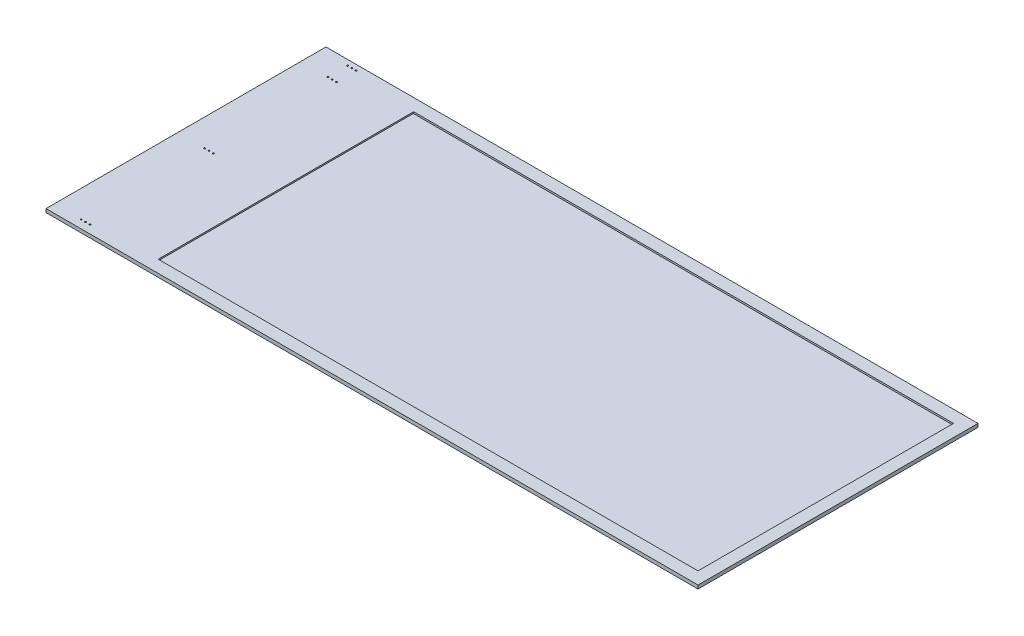
ISO-10303-21;
HEADER;
FILE_DESCRIPTION(('STEP AP214'),'2;1');
FILE_NAME('part.step','',(''),(''),'','','');
FILE_SCHEMA(('AUTOMOTIVE_DESIGN { 1 0 10303 214 1 1 1 1 }'));
ENDSEC;
DATA;
#1=APPLICATION_CONTEXT('core data for automotive mechanical design processes');
#2=APPLICATION_PROTOCOL_DEFINITION('international standard','automotive_design',2000,#1);
#3=PRODUCT_CONTEXT('',#1,'mechanical');
#4=PRODUCT('Part','Part','',(#3));
#5=PRODUCT_RELATED_PRODUCT_CATEGORY('part','',(#4));
#6=PRODUCT_DEFINITION_FORMATION('','',#4);
#7=PRODUCT_DEFINITION_CONTEXT('part definition',#1,'design');
#8=PRODUCT_DEFINITION('design','',#6,#7);
#9=PRODUCT_DEFINITION_SHAPE('','',#8);
#10=(LENGTH_UNIT() NAMED_UNIT(*) SI_UNIT(.MILLI.,.METRE.));
#11=(NAMED_UNIT(*) PLANE_ANGLE_UNIT() SI_UNIT($,.RADIAN.));
#12=(NAMED_UNIT(*) SI_UNIT($,.STERADIAN.) SOLID_ANGLE_UNIT());
#13=UNCERTAINTY_MEASURE_WITH_UNIT(LENGTH_MEASURE(1.E-05),#10,'distance_accuracy_value','');
#14=(GEOMETRIC_REPRESENTATION_CONTEXT(3) GLOBAL_UNCERTAINTY_ASSIGNED_CONTEXT((#13)) GLOBAL_UNIT_ASSIGNED_CONTEXT((#10,
#11,#12)) REPRESENTATION_CONTEXT('',''));
#15=CARTESIAN_POINT('',(0.,0.,0.));
#16=DIRECTION('',(0.,0.,1.));
#17=DIRECTION('',(1.,0.,0.));
#18=AXIS2_PLACEMENT_3D('',#15,#16,#17);
#19=CARTESIAN_POINT('',(125.4125,3.175,-485.775));
#20=DIRECTION('',(-1.,0.,0.));
#21=DIRECTION('',(0.,0.,1.));
#22=AXIS2_PLACEMENT_3D('',#19,#20,#21);
#23=PLANE('',#22);
#24=DIRECTION('',(0.,0.,-1.));
#25=VECTOR('',#24,1.);
#26=CARTESIAN_POINT('',(125.4125,3.81,0.));
#27=LINE('',#26,#25);
#28=CARTESIAN_POINT('',(125.4125,3.81,-22.225));
#29=VERTEX_POINT('',#28);
#30=CARTESIAN_POINT('',(125.4125,3.81,-485.775));
#31=VERTEX_POINT('',#30);
#32=EDGE_CURVE('E167',#29,#31,#27,.T.);
#33=ORIENTED_EDGE('',*,*,#32,.F.);
#34=DIRECTION('',(0.,1.,0.));
#35=VECTOR('',#34,1.);
#36=CARTESIAN_POINT('',(125.4125,3.175,-22.225));
#37=LINE('',#36,#35);
#38=CARTESIAN_POINT('',(125.4125,3.175,-22.225));
#39=VERTEX_POINT('',#38);
#40=EDGE_CURVE('E250',#39,#29,#37,.T.);
#41=ORIENTED_EDGE('',*,*,#40,.F.);
#42=DIRECTION('',(0.,0.,1.));
#43=VECTOR('',#42,1.);
#44=CARTESIAN_POINT('',(125.4125,3.175,-485.775));
#45=LINE('',#44,#43);
#46=CARTESIAN_POINT('',(125.4125,3.175,-485.775));
#47=VERTEX_POINT('',#46);
#48=EDGE_CURVE('E124',#47,#39,#45,.T.);
#49=ORIENTED_EDGE('',*,*,#48,.F.);
#50=DIRECTION('',(0.,1.,0.));
#51=VECTOR('',#50,1.);
#52=CARTESIAN_POINT('',(125.4125,3.175,-485.775));
#53=LINE('',#52,#51);
#54=EDGE_CURVE('E253',#47,#31,#53,.T.);
#55=ORIENTED_EDGE('',*,*,#54,.T.);
#56=EDGE_LOOP('',(#33,#41,#49,#55));
#57=FACE_BOUND('',#56,.T.);
#58=ADVANCED_FACE('F41',(#57),#23,.F.);
#59=CARTESIAN_POINT('',(0.,6.35,0.));
#60=DIRECTION('',(1.,0.,0.));
#61=DIRECTION('',(0.,0.,-1.));
#62=AXIS2_PLACEMENT_3D('',#59,#60,#61);
#63=PLANE('',#62);
#64=DIRECTION('',(0.,0.,1.));
#65=VECTOR('',#64,1.);
#66=CARTESIAN_POINT('',(0.,0.,0.));
#67=LINE('',#66,#65);
#68=CARTESIAN_POINT('',(0.,0.,-508.));
#69=VERTEX_POINT('',#68);
#70=CARTESIAN_POINT('',(0.,0.,0.));
#71=VERTEX_POINT('',#70);
#72=EDGE_CURVE('E255',#69,#71,#67,.T.);
#73=ORIENTED_EDGE('',*,*,#72,.T.);
#74=DIRECTION('',(0.,-1.,0.));
#75=VECTOR('',#74,1.);
#76=CARTESIAN_POINT('',(0.,6.35,0.));
#77=LINE('',#76,#75);
#78=CARTESIAN_POINT('',(0.,6.35,0.));
#79=VERTEX_POINT('',#78);
#80=EDGE_CURVE('E11',#79,#71,#77,.T.);
#81=ORIENTED_EDGE('',*,*,#80,.F.);
#82=DIRECTION('',(0.,0.,1.));
#83=VECTOR('',#82,1.);
#84=CARTESIAN_POINT('',(0.,6.35,0.));
#85=LINE('',#84,#83);
#86=CARTESIAN_POINT('',(0.,6.35,-508.));
#87=VERTEX_POINT('',#86);
#88=EDGE_CURVE('E257',#87,#79,#85,.T.);
#89=ORIENTED_EDGE('',*,*,#88,.F.);
#90=DIRECTION('',(0.,-1.,0.));
#91=VECTOR('',#90,1.);
#92=CARTESIAN_POINT('',(0.,6.35,-508.));
#93=LINE('',#92,#91);
#94=EDGE_CURVE('E49',#87,#69,#93,.T.);
#95=ORIENTED_EDGE('',*,*,#94,.T.);
#96=EDGE_LOOP('',(#73,#81,#89,#95));
#97=FACE_BOUND('',#96,.T.);
#98=ADVANCED_FACE('F43',(#97),#63,.F.);
#99=CARTESIAN_POINT('',(0.,6.35,0.));
#100=DIRECTION('',(0.,0.,-1.));
#101=DIRECTION('',(-1.,0.,0.));
#102=AXIS2_PLACEMENT_3D('',#99,#100,#101);
#103=PLANE('',#102);
#104=DIRECTION('',(1.,0.,0.));
#105=VECTOR('',#104,1.);
#106=CARTESIAN_POINT('',(0.,0.,0.));
#107=LINE('',#106,#105);
#108=CARTESIAN_POINT('',(1183.0812,0.,0.));
#109=VERTEX_POINT('',#108);
#110=EDGE_CURVE('E267',#71,#109,#107,.T.);
#111=ORIENTED_EDGE('',*,*,#110,.T.);
#112=DIRECTION('',(0.,1.,0.));
#113=VECTOR('',#112,1.);
#114=CARTESIAN_POINT('',(1183.0812,0.,0.));
#115=LINE('',#114,#113);
#116=CARTESIAN_POINT('',(1183.0812,6.35,0.));
#117=VERTEX_POINT('',#116);
#118=EDGE_CURVE('E151',#109,#117,#115,.T.);
#119=ORIENTED_EDGE('',*,*,#118,.T.);
#120=DIRECTION('',(1.,0.,0.));
#121=VECTOR('',#120,1.);
#122=CARTESIAN_POINT('',(0.,6.35,0.));
#123=LINE('',#122,#121);
#124=EDGE_CURVE('E260',#79,#117,#123,.T.);
#125=ORIENTED_EDGE('',*,*,#124,.F.);
#126=ORIENTED_EDGE('',*,*,#80,.T.);
#127=EDGE_LOOP('',(#111,#119,#125,#126));
#128=FACE_BOUND('',#127,.T.);
#129=ADVANCED_FACE('F282',(#128),#103,.F.);
#130=CARTESIAN_POINT('',(0.,6.35,-508.));
#131=DIRECTION('',(0.,0.,1.));
#132=DIRECTION('',(1.,0.,0.));
#133=AXIS2_PLACEMENT_3D('',#130,#131,#132);
#134=PLANE('',#133);
#135=DIRECTION('',(-1.,0.,0.));
#136=VECTOR('',#135,1.);
#137=CARTESIAN_POINT('',(0.,0.,-508.));
#138=LINE('',#137,#136);
#139=CARTESIAN_POINT('',(1183.0812,0.,-508.));
#140=VERTEX_POINT('',#139);
#141=EDGE_CURVE('E261',#140,#69,#138,.T.);
#142=ORIENTED_EDGE('',*,*,#141,.T.);
#143=ORIENTED_EDGE('',*,*,#94,.F.);
#144=DIRECTION('',(-1.,0.,0.));
#145=VECTOR('',#144,1.);
#146=CARTESIAN_POINT('',(0.,6.35,-508.));
#147=LINE('',#146,#145);
#148=CARTESIAN_POINT('',(1183.0812,6.35,-508.));
#149=VERTEX_POINT('',#148);
#150=EDGE_CURVE('E263',#149,#87,#147,.T.);
#151=ORIENTED_EDGE('',*,*,#150,.F.);
#152=DIRECTION('',(0.,1.,0.));
#153=VECTOR('',#152,1.);
#154=CARTESIAN_POINT('',(1183.0812,0.,-508.));
#155=LINE('',#154,#153);
#156=EDGE_CURVE('E154',#140,#149,#155,.T.);
#157=ORIENTED_EDGE('',*,*,#156,.F.);
#158=EDGE_LOOP('',(#142,#143,#151,#157));
#159=FACE_BOUND('',#158,.T.);
#160=ADVANCED_FACE('F286',(#159),#134,.F.);
#161=CARTESIAN_POINT('',(0.,6.35,0.));
#162=DIRECTION('',(0.,-1.,0.));
#163=DIRECTION('',(0.,0.,-1.));
#164=AXIS2_PLACEMENT_3D('',#161,#162,#163);
#165=PLANE('',#164);
#166=DIRECTION('',(-1.,0.,0.));
#167=VECTOR('',#166,1.);
#168=CARTESIAN_POINT('',(125.4125,6.35,-485.775));
#169=LINE('',#168,#167);
#170=CARTESIAN_POINT('',(1160.8562,6.35,-485.775));
#171=VERTEX_POINT('',#170);
#172=CARTESIAN_POINT('',(181.3306,6.35,-485.775));
#173=VERTEX_POINT('',#172);
#174=EDGE_CURVE('E247',#171,#173,#169,.T.);
#175=ORIENTED_EDGE('',*,*,#174,.F.);
#176=DIRECTION('',(0.,0.,-1.));
#177=VECTOR('',#176,1.);
#178=CARTESIAN_POINT('',(1160.8562,6.35,-485.775));
#179=LINE('',#178,#177);
#180=CARTESIAN_POINT('',(1160.8562,6.35,-22.225));
#181=VERTEX_POINT('',#180);
#182=EDGE_CURVE('E142',#181,#171,#179,.T.);
#183=ORIENTED_EDGE('',*,*,#182,.F.);
#184=DIRECTION('',(1.,0.,0.));
#185=VECTOR('',#184,1.);
#186=CARTESIAN_POINT('',(125.4125,6.35,-22.225));
#187=LINE('',#186,#185);
#188=CARTESIAN_POINT('',(181.3306,6.35,-22.225));
#189=VERTEX_POINT('',#188);
#190=EDGE_CURVE('E133',#189,#181,#187,.T.);
#191=ORIENTED_EDGE('',*,*,#190,.F.);
#192=DIRECTION('',(0.,0.,-1.));
#193=VECTOR('',#192,1.);
#194=CARTESIAN_POINT('',(181.3306,6.35,0.));
#195=LINE('',#194,#193);
#196=EDGE_CURVE('E157',#189,#173,#195,.T.);
#197=ORIENTED_EDGE('',*,*,#196,.T.);
#198=EDGE_LOOP('',(#175,#183,#191,#197));
#199=FACE_BOUND('',#198,.T.);
#200=CARTESIAN_POINT('',(64.5413999999999,6.35,-498.094));
#201=DIRECTION('',(0.,1.,0.));
#202=DIRECTION('',(0.,0.,1.));
#203=AXIS2_PLACEMENT_3D('',#200,#201,#202);
#204=CIRCLE('',#203,1.3589);
#205=CARTESIAN_POINT('',(64.5413999999999,6.35,-496.7351));
#206=VERTEX_POINT('',#205);
#207=EDGE_CURVE('E206',#206,#206,#204,.T.);
#208=ORIENTED_EDGE('',*,*,#207,.F.);
#209=EDGE_LOOP('',(#208));
#210=FACE_BOUND('',#209,.T.);
#211=CARTESIAN_POINT('',(49.1489999999999,6.35,-14.8082));
#212=DIRECTION('',(0.,1.,0.));
#213=DIRECTION('',(0.,0.,1.));
#214=AXIS2_PLACEMENT_3D('',#211,#212,#213);
#215=CIRCLE('',#214,1.35889999999999);
#216=CARTESIAN_POINT('',(49.1489999999999,6.35,-13.4493));
#217=VERTEX_POINT('',#216);
#218=EDGE_CURVE('E213',#217,#217,#215,.T.);
#219=ORIENTED_EDGE('',*,*,#218,.F.);
#220=EDGE_LOOP('',(#219));
#221=FACE_BOUND('',#220,.T.);
#222=CARTESIAN_POINT('',(57.0991999999999,6.35,-14.8082));
#223=DIRECTION('',(0.,1.,0.));
#224=DIRECTION('',(0.,0.,1.));
#225=AXIS2_PLACEMENT_3D('',#222,#223,#224);
#226=CIRCLE('',#225,1.35889999999999);
#227=CARTESIAN_POINT('',(57.0991999999999,6.35,-13.4493));
#228=VERTEX_POINT('',#227);
#229=EDGE_CURVE('E194',#228,#228,#226,.T.);
#230=ORIENTED_EDGE('',*,*,#229,.F.);
#231=EDGE_LOOP('',(#230));
#232=FACE_BOUND('',#231,.T.);
#233=CARTESIAN_POINT('',(65.0493999999999,6.35,-14.8082));
#234=DIRECTION('',(0.,1.,0.));
#235=DIRECTION('',(0.,0.,1.));
#236=AXIS2_PLACEMENT_3D('',#233,#234,#235);
#237=CIRCLE('',#236,1.3589);
#238=CARTESIAN_POINT('',(65.0493999999999,6.35,-13.4493));
#239=VERTEX_POINT('',#238);
#240=EDGE_CURVE('E201',#239,#239,#237,.T.);
#241=ORIENTED_EDGE('',*,*,#240,.F.);
#242=EDGE_LOOP('',(#241));
#243=FACE_BOUND('',#242,.T.);
#244=CARTESIAN_POINT('',(49.1489999999999,6.35,-498.094));
#245=DIRECTION('',(0.,1.,0.));
#246=DIRECTION('',(0.,0.,1.));
#247=AXIS2_PLACEMENT_3D('',#244,#245,#246);
#248=CIRCLE('',#247,1.3589);
#249=CARTESIAN_POINT('',(49.1489999999999,6.35,-496.7351));
#250=VERTEX_POINT('',#249);
#251=EDGE_CURVE('E230',#250,#250,#248,.T.);
#252=ORIENTED_EDGE('',*,*,#251,.F.);
#253=EDGE_LOOP('',(#252));
#254=FACE_BOUND('',#253,.T.);
#255=CARTESIAN_POINT('',(56.8451999999999,6.35,-462.4832));
#256=DIRECTION('',(0.,1.,0.));
#257=DIRECTION('',(0.,0.,1.));
#258=AXIS2_PLACEMENT_3D('',#255,#256,#257);
#259=CIRCLE('',#258,1.3589);
#260=CARTESIAN_POINT('',(56.8451999999999,6.35,-461.1243));
#261=VERTEX_POINT('',#260);
#262=EDGE_CURVE('E237',#261,#261,#259,.T.);
#263=ORIENTED_EDGE('',*,*,#262,.F.);
#264=EDGE_LOOP('',(#263));
#265=FACE_BOUND('',#264,.T.);
#266=CARTESIAN_POINT('',(56.8451999999999,6.35,-498.094));
#267=DIRECTION('',(0.,1.,0.));
#268=DIRECTION('',(0.,0.,1.));
#269=AXIS2_PLACEMENT_3D('',#266,#267,#268);
#270=CIRCLE('',#269,1.3589);
#271=CARTESIAN_POINT('',(56.8451999999999,6.35,-496.7351));
#272=VERTEX_POINT('',#271);
#273=EDGE_CURVE('E218',#272,#272,#270,.T.);
#274=ORIENTED_EDGE('',*,*,#273,.F.);
#275=EDGE_LOOP('',(#274));
#276=FACE_BOUND('',#275,.T.);
#277=CARTESIAN_POINT('',(64.5413999999999,6.35,-462.4832));
#278=DIRECTION('',(0.,1.,0.));
#279=DIRECTION('',(0.,0.,1.));
#280=AXIS2_PLACEMENT_3D('',#277,#278,#279);
#281=CIRCLE('',#280,1.3589);
#282=CARTESIAN_POINT('',(64.5413999999999,6.35,-461.1243));
#283=VERTEX_POINT('',#282);
#284=EDGE_CURVE('E225',#283,#283,#281,.T.);
#285=ORIENTED_EDGE('',*,*,#284,.F.);
#286=EDGE_LOOP('',(#285));
#287=FACE_BOUND('',#286,.T.);
#288=CARTESIAN_POINT('',(49.1489999999999,6.35,-238.6457));
#289=DIRECTION('',(0.,1.,0.));
#290=DIRECTION('',(0.,0.,1.));
#291=AXIS2_PLACEMENT_3D('',#288,#289,#290);
#292=CIRCLE('',#291,1.35889999999999);
#293=CARTESIAN_POINT('',(49.1489999999999,6.35,-237.2868));
#294=VERTEX_POINT('',#293);
#295=EDGE_CURVE('E176',#294,#294,#292,.T.);
#296=ORIENTED_EDGE('',*,*,#295,.F.);
#297=EDGE_LOOP('',(#296));
#298=FACE_BOUND('',#297,.T.);
#299=CARTESIAN_POINT('',(57.0991999999999,6.35,-238.6457));
#300=DIRECTION('',(0.,1.,0.));
#301=DIRECTION('',(0.,0.,1.));
#302=AXIS2_PLACEMENT_3D('',#299,#300,#301);
#303=CIRCLE('',#302,1.35889999999999);
#304=CARTESIAN_POINT('',(57.0991999999999,6.35,-237.2868));
#305=VERTEX_POINT('',#304);
#306=EDGE_CURVE('E183',#305,#305,#303,.T.);
#307=ORIENTED_EDGE('',*,*,#306,.F.);
#308=EDGE_LOOP('',(#307));
#309=FACE_BOUND('',#308,.T.);
#310=CARTESIAN_POINT('',(65.0493999999999,6.35,-238.6457));
#311=DIRECTION('',(0.,1.,0.));
#312=DIRECTION('',(0.,0.,1.));
#313=AXIS2_PLACEMENT_3D('',#310,#311,#312);
#314=CIRCLE('',#313,1.3589);
#315=CARTESIAN_POINT('',(65.0493999999999,6.35,-237.2868));
#316=VERTEX_POINT('',#315);
#317=EDGE_CURVE('E189',#316,#316,#314,.T.);
#318=ORIENTED_EDGE('',*,*,#317,.F.);
#319=EDGE_LOOP('',(#318));
#320=FACE_BOUND('',#319,.T.);
#321=CARTESIAN_POINT('',(49.1489999999999,6.35,-462.4832));
#322=DIRECTION('',(0.,1.,0.));
#323=DIRECTION('',(0.,0.,1.));
#324=AXIS2_PLACEMENT_3D('',#321,#322,#323);
#325=CIRCLE('',#324,1.3589);
#326=CARTESIAN_POINT('',(49.1489999999999,6.35,-461.1243));
#327=VERTEX_POINT('',#326);
#328=EDGE_CURVE('E233',#327,#327,#325,.T.);
#329=ORIENTED_EDGE('',*,*,#328,.F.);
#330=EDGE_LOOP('',(#329));
#331=FACE_BOUND('',#330,.T.);
#332=ORIENTED_EDGE('',*,*,#88,.T.);
#333=ORIENTED_EDGE('',*,*,#124,.T.);
#334=DIRECTION('',(0.,0.,-1.));
#335=VECTOR('',#334,1.);
#336=CARTESIAN_POINT('',(1183.0812,6.35,-508.));
#337=LINE('',#336,#335);
#338=EDGE_CURVE('E146',#117,#149,#337,.T.);
#339=ORIENTED_EDGE('',*,*,#338,.T.);
#340=ORIENTED_EDGE('',*,*,#150,.T.);
#341=EDGE_LOOP('',(#332,#333,#339,#340));
#342=FACE_BOUND('',#341,.T.);
#343=ADVANCED_FACE('F285',(#199,#210,#221,#232,#243,#254,#265,#276,#287,#298,#309,#320,#331,
#342),#165,.F.);
#344=CARTESIAN_POINT('',(0.,0.,0.));
#345=DIRECTION('',(0.,-1.,0.));
#346=DIRECTION('',(0.,0.,-1.));
#347=AXIS2_PLACEMENT_3D('',#344,#345,#346);
#348=PLANE('',#347);
#349=CARTESIAN_POINT('',(64.5413999999999,0.,-498.094));
#350=DIRECTION('',(0.,1.,0.));
#351=DIRECTION('',(0.,0.,1.));
#352=AXIS2_PLACEMENT_3D('',#349,#350,#351);
#353=CIRCLE('',#352,1.3589);
#354=CARTESIAN_POINT('',(64.5413999999999,0.,-496.7351));
#355=VERTEX_POINT('',#354);
#356=EDGE_CURVE('E210',#355,#355,#353,.T.);
#357=ORIENTED_EDGE('',*,*,#356,.T.);
#358=EDGE_LOOP('',(#357));
#359=FACE_BOUND('',#358,.T.);
#360=CARTESIAN_POINT('',(49.1489999999999,0.,-14.8082));
#361=DIRECTION('',(0.,1.,0.));
#362=DIRECTION('',(0.,0.,1.));
#363=AXIS2_PLACEMENT_3D('',#360,#361,#362);
#364=CIRCLE('',#363,1.35889999999999);
#365=CARTESIAN_POINT('',(49.1489999999999,0.,-13.4493));
#366=VERTEX_POINT('',#365);
#367=EDGE_CURVE('E197',#366,#366,#364,.T.);
#368=ORIENTED_EDGE('',*,*,#367,.T.);
#369=EDGE_LOOP('',(#368));
#370=FACE_BOUND('',#369,.T.);
#371=CARTESIAN_POINT('',(57.0991999999999,0.,-14.8082));
#372=DIRECTION('',(0.,1.,0.));
#373=DIRECTION('',(0.,0.,1.));
#374=AXIS2_PLACEMENT_3D('',#371,#372,#373);
#375=CIRCLE('',#374,1.35889999999999);
#376=CARTESIAN_POINT('',(57.0991999999999,0.,-13.4493));
#377=VERTEX_POINT('',#376);
#378=EDGE_CURVE('E198',#377,#377,#375,.T.);
#379=ORIENTED_EDGE('',*,*,#378,.T.);
#380=EDGE_LOOP('',(#379));
#381=FACE_BOUND('',#380,.T.);
#382=CARTESIAN_POINT('',(65.0493999999999,0.,-14.8082));
#383=DIRECTION('',(0.,1.,0.));
#384=DIRECTION('',(0.,0.,1.));
#385=AXIS2_PLACEMENT_3D('',#382,#383,#384);
#386=CIRCLE('',#385,1.3589);
#387=CARTESIAN_POINT('',(65.0493999999999,0.,-13.4493));
#388=VERTEX_POINT('',#387);
#389=EDGE_CURVE('E179',#388,#388,#386,.T.);
#390=ORIENTED_EDGE('',*,*,#389,.T.);
#391=EDGE_LOOP('',(#390));
#392=FACE_BOUND('',#391,.T.);
#393=CARTESIAN_POINT('',(49.1489999999999,0.,-498.094));
#394=DIRECTION('',(0.,1.,0.));
#395=DIRECTION('',(0.,0.,1.));
#396=AXIS2_PLACEMENT_3D('',#393,#394,#395);
#397=CIRCLE('',#396,1.3589);
#398=CARTESIAN_POINT('',(49.1489999999999,0.,-496.7351));
#399=VERTEX_POINT('',#398);
#400=EDGE_CURVE('E234',#399,#399,#397,.T.);
#401=ORIENTED_EDGE('',*,*,#400,.T.);
#402=EDGE_LOOP('',(#401));
#403=FACE_BOUND('',#402,.T.);
#404=CARTESIAN_POINT('',(56.8451999999999,0.,-462.4832));
#405=DIRECTION('',(0.,1.,0.));
#406=DIRECTION('',(0.,0.,1.));
#407=AXIS2_PLACEMENT_3D('',#404,#405,#406);
#408=CIRCLE('',#407,1.3589);
#409=CARTESIAN_POINT('',(56.8451999999999,0.,-461.1243));
#410=VERTEX_POINT('',#409);
#411=EDGE_CURVE('E221',#410,#410,#408,.T.);
#412=ORIENTED_EDGE('',*,*,#411,.T.);
#413=EDGE_LOOP('',(#412));
#414=FACE_BOUND('',#413,.T.);
#415=CARTESIAN_POINT('',(56.8451999999999,0.,-498.094));
#416=DIRECTION('',(0.,1.,0.));
#417=DIRECTION('',(0.,0.,1.));
#418=AXIS2_PLACEMENT_3D('',#415,#416,#417);
#419=CIRCLE('',#418,1.3589);
#420=CARTESIAN_POINT('',(56.8451999999999,0.,-496.7351));
#421=VERTEX_POINT('',#420);
#422=EDGE_CURVE('E222',#421,#421,#419,.T.);
#423=ORIENTED_EDGE('',*,*,#422,.T.);
#424=EDGE_LOOP('',(#423));
#425=FACE_BOUND('',#424,.T.);
#426=CARTESIAN_POINT('',(64.5413999999999,0.,-462.4832));
#427=DIRECTION('',(0.,1.,0.));
#428=DIRECTION('',(0.,0.,1.));
#429=AXIS2_PLACEMENT_3D('',#426,#427,#428);
#430=CIRCLE('',#429,1.3589);
#431=CARTESIAN_POINT('',(64.5413999999999,0.,-461.1243));
#432=VERTEX_POINT('',#431);
#433=EDGE_CURVE('E209',#432,#432,#430,.T.);
#434=ORIENTED_EDGE('',*,*,#433,.T.);
#435=EDGE_LOOP('',(#434));
#436=FACE_BOUND('',#435,.T.);
#437=CARTESIAN_POINT('',(49.1489999999999,0.,-238.6457));
#438=DIRECTION('',(0.,1.,0.));
#439=DIRECTION('',(0.,0.,1.));
#440=AXIS2_PLACEMENT_3D('',#437,#438,#439);
#441=CIRCLE('',#440,1.35889999999999);
#442=CARTESIAN_POINT('',(49.1489999999999,0.,-237.2868));
#443=VERTEX_POINT('',#442);
#444=EDGE_CURVE('E180',#443,#443,#441,.T.);
#445=ORIENTED_EDGE('',*,*,#444,.T.);
#446=EDGE_LOOP('',(#445));
#447=FACE_BOUND('',#446,.T.);
#448=CARTESIAN_POINT('',(57.0991999999999,0.,-238.6457));
#449=DIRECTION('',(0.,1.,0.));
#450=DIRECTION('',(0.,0.,1.));
#451=AXIS2_PLACEMENT_3D('',#448,#449,#450);
#452=CIRCLE('',#451,1.35889999999999);
#453=CARTESIAN_POINT('',(57.0991999999999,0.,-237.2868));
#454=VERTEX_POINT('',#453);
#455=EDGE_CURVE('E186',#454,#454,#452,.T.);
#456=ORIENTED_EDGE('',*,*,#455,.T.);
#457=EDGE_LOOP('',(#456));
#458=FACE_BOUND('',#457,.T.);
#459=CARTESIAN_POINT('',(65.0493999999999,0.,-238.6457));
#460=DIRECTION('',(0.,1.,0.));
#461=DIRECTION('',(0.,0.,1.));
#462=AXIS2_PLACEMENT_3D('',#459,#460,#461);
#463=CIRCLE('',#462,1.3589);
#464=CARTESIAN_POINT('',(65.0493999999999,0.,-237.2868));
#465=VERTEX_POINT('',#464);
#466=EDGE_CURVE('E174',#465,#465,#463,.T.);
#467=ORIENTED_EDGE('',*,*,#466,.T.);
#468=EDGE_LOOP('',(#467));
#469=FACE_BOUND('',#468,.T.);
#470=CARTESIAN_POINT('',(49.1489999999999,0.,-462.4832));
#471=DIRECTION('',(0.,1.,0.));
#472=DIRECTION('',(0.,0.,1.));
#473=AXIS2_PLACEMENT_3D('',#470,#471,#472);
#474=CIRCLE('',#473,1.3589);
#475=CARTESIAN_POINT('',(49.1489999999999,0.,-461.1243));
#476=VERTEX_POINT('',#475);
#477=EDGE_CURVE('E242',#476,#476,#474,.T.);
#478=ORIENTED_EDGE('',*,*,#477,.T.);
#479=EDGE_LOOP('',(#478));
#480=FACE_BOUND('',#479,.T.);
#481=ORIENTED_EDGE('',*,*,#72,.F.);
#482=ORIENTED_EDGE('',*,*,#141,.F.);
#483=DIRECTION('',(0.,0.,-1.));
#484=VECTOR('',#483,1.);
#485=CARTESIAN_POINT('',(1183.0812,0.,-508.));
#486=LINE('',#485,#484);
#487=EDGE_CURVE('E148',#109,#140,#486,.T.);
#488=ORIENTED_EDGE('',*,*,#487,.F.);
#489=ORIENTED_EDGE('',*,*,#110,.F.);
#490=EDGE_LOOP('',(#481,#482,#488,#489));
#491=FACE_BOUND('',#490,.T.);
#492=ADVANCED_FACE('F277',(#359,#370,#381,#392,#403,#414,#425,#436,#447,#458,#469,#480,#491),
#348,.T.);
#493=CARTESIAN_POINT('',(125.4125,3.175,-485.775));
#494=DIRECTION('',(0.,0.,-1.));
#495=DIRECTION('',(-1.,0.,0.));
#496=AXIS2_PLACEMENT_3D('',#493,#494,#495);
#497=PLANE('',#496);
#498=ORIENTED_EDGE('',*,*,#174,.T.);
#499=DIRECTION('',(0.,1.,0.));
#500=VECTOR('',#499,1.);
#501=CARTESIAN_POINT('',(181.3306,3.81,-485.775));
#502=LINE('',#501,#500);
#503=CARTESIAN_POINT('',(181.3306,3.81,-485.775));
#504=VERTEX_POINT('',#503);
#505=EDGE_CURVE('E56',#504,#173,#502,.T.);
#506=ORIENTED_EDGE('',*,*,#505,.F.);
#507=DIRECTION('',(1.,0.,0.));
#508=VECTOR('',#507,1.);
#509=CARTESIAN_POINT('',(0.,3.81,-485.775));
#510=LINE('',#509,#508);
#511=EDGE_CURVE('E60',#31,#504,#510,.T.);
#512=ORIENTED_EDGE('',*,*,#511,.F.);
#513=ORIENTED_EDGE('',*,*,#54,.F.);
#514=DIRECTION('',(-1.,0.,0.));
#515=VECTOR('',#514,1.);
#516=CARTESIAN_POINT('',(125.4125,3.175,-485.775));
#517=LINE('',#516,#515);
#518=CARTESIAN_POINT('',(1160.8562,3.175,-485.775));
#519=VERTEX_POINT('',#518);
#520=EDGE_CURVE('E127',#519,#47,#517,.T.);
#521=ORIENTED_EDGE('',*,*,#520,.F.);
#522=DIRECTION('',(0.,1.,0.));
#523=VECTOR('',#522,1.);
#524=CARTESIAN_POINT('',(1160.8562,3.175,-485.775));
#525=LINE('',#524,#523);
#526=EDGE_CURVE('E137',#519,#171,#525,.T.);
#527=ORIENTED_EDGE('',*,*,#526,.T.);
#528=EDGE_LOOP('',(#498,#506,#512,#513,#521,#527));
#529=FACE_BOUND('',#528,.T.);
#530=ADVANCED_FACE('F316',(#529),#497,.F.);
#531=CARTESIAN_POINT('',(125.4125,3.175,-22.225));
#532=DIRECTION('',(0.,0.,1.));
#533=DIRECTION('',(1.,0.,0.));
#534=AXIS2_PLACEMENT_3D('',#531,#532,#533);
#535=PLANE('',#534);
#536=DIRECTION('',(-1.,0.,0.));
#537=VECTOR('',#536,1.);
#538=CARTESIAN_POINT('',(0.,3.81,-22.225));
#539=LINE('',#538,#537);
#540=CARTESIAN_POINT('',(181.3306,3.81,-22.225));
#541=VERTEX_POINT('',#540);
#542=EDGE_CURVE('E160',#541,#29,#539,.T.);
#543=ORIENTED_EDGE('',*,*,#542,.F.);
#544=DIRECTION('',(0.,1.,0.));
#545=VECTOR('',#544,1.);
#546=CARTESIAN_POINT('',(181.3306,3.81,-22.225));
#547=LINE('',#546,#545);
#548=EDGE_CURVE('E170',#541,#189,#547,.T.);
#549=ORIENTED_EDGE('',*,*,#548,.T.);
#550=ORIENTED_EDGE('',*,*,#190,.T.);
#551=DIRECTION('',(0.,1.,0.));
#552=VECTOR('',#551,1.);
#553=CARTESIAN_POINT('',(1160.8562,3.175,-22.225));
#554=LINE('',#553,#552);
#555=CARTESIAN_POINT('',(1160.8562,3.175,-22.225));
#556=VERTEX_POINT('',#555);
#557=EDGE_CURVE('E130',#556,#181,#554,.T.);
#558=ORIENTED_EDGE('',*,*,#557,.F.);
#559=DIRECTION('',(1.,0.,0.));
#560=VECTOR('',#559,1.);
#561=CARTESIAN_POINT('',(125.4125,3.175,-22.225));
#562=LINE('',#561,#560);
#563=EDGE_CURVE('E117',#39,#556,#562,.T.);
#564=ORIENTED_EDGE('',*,*,#563,.F.);
#565=ORIENTED_EDGE('',*,*,#40,.T.);
#566=EDGE_LOOP('',(#543,#549,#550,#558,#564,#565));
#567=FACE_BOUND('',#566,.T.);
#568=ADVANCED_FACE('F131',(#567),#535,.F.);
#569=CARTESIAN_POINT('',(0.,3.175,0.));
#570=DIRECTION('',(0.,1.,0.));
#571=DIRECTION('',(0.,0.,1.));
#572=AXIS2_PLACEMENT_3D('',#569,#570,#571);
#573=PLANE('',#572);
#574=ORIENTED_EDGE('',*,*,#48,.T.);
#575=ORIENTED_EDGE('',*,*,#563,.T.);
#576=DIRECTION('',(0.,0.,-1.));
#577=VECTOR('',#576,1.);
#578=CARTESIAN_POINT('',(1160.8562,3.175,-485.775));
#579=LINE('',#578,#577);
#580=EDGE_CURVE('E122',#556,#519,#579,.T.);
#581=ORIENTED_EDGE('',*,*,#580,.T.);
#582=ORIENTED_EDGE('',*,*,#520,.T.);
#583=EDGE_LOOP('',(#574,#575,#581,#582));
#584=FACE_BOUND('',#583,.T.);
#585=ADVANCED_FACE('F119',(#584),#573,.T.);
#586=CARTESIAN_POINT('',(49.1489999999999,0.,-462.4832));
#587=DIRECTION('',(0.,1.,0.));
#588=DIRECTION('',(0.,0.,1.));
#589=AXIS2_PLACEMENT_3D('',#586,#587,#588);
#590=CYLINDRICAL_SURFACE('',#589,1.3589);
#591=ORIENTED_EDGE('',*,*,#477,.F.);
#592=EDGE_LOOP('',(#591));
#593=FACE_BOUND('',#592,.T.);
#594=ORIENTED_EDGE('',*,*,#328,.T.);
#595=EDGE_LOOP('',(#594));
#596=FACE_BOUND('',#595,.T.);
#597=ADVANCED_FACE('F354',(#593,#596),#590,.F.);
#598=CARTESIAN_POINT('',(65.0493999999999,0.,-238.6457));
#599=DIRECTION('',(0.,1.,0.));
#600=DIRECTION('',(0.,0.,1.));
#601=AXIS2_PLACEMENT_3D('',#598,#599,#600);
#602=CYLINDRICAL_SURFACE('',#601,1.3589);
#603=ORIENTED_EDGE('',*,*,#466,.F.);
#604=EDGE_LOOP('',(#603));
#605=FACE_BOUND('',#604,.T.);
#606=ORIENTED_EDGE('',*,*,#317,.T.);
#607=EDGE_LOOP('',(#606));
#608=FACE_BOUND('',#607,.T.);
#609=ADVANCED_FACE('F530',(#605,#608),#602,.F.);
#610=CARTESIAN_POINT('',(57.0991999999999,0.,-238.6457));
#611=DIRECTION('',(0.,1.,0.));
#612=DIRECTION('',(0.,0.,1.));
#613=AXIS2_PLACEMENT_3D('',#610,#611,#612);
#614=CYLINDRICAL_SURFACE('',#613,1.35889999999999);
#615=ORIENTED_EDGE('',*,*,#455,.F.);
#616=EDGE_LOOP('',(#615));
#617=FACE_BOUND('',#616,.T.);
#618=ORIENTED_EDGE('',*,*,#306,.T.);
#619=EDGE_LOOP('',(#618));
#620=FACE_BOUND('',#619,.T.);
#621=ADVANCED_FACE('F520',(#617,#620),#614,.F.);
#622=CARTESIAN_POINT('',(49.1489999999999,0.,-238.6457));
#623=DIRECTION('',(0.,1.,0.));
#624=DIRECTION('',(0.,0.,1.));
#625=AXIS2_PLACEMENT_3D('',#622,#623,#624);
#626=CYLINDRICAL_SURFACE('',#625,1.35889999999999);
#627=ORIENTED_EDGE('',*,*,#444,.F.);
#628=EDGE_LOOP('',(#627));
#629=FACE_BOUND('',#628,.T.);
#630=ORIENTED_EDGE('',*,*,#295,.T.);
#631=EDGE_LOOP('',(#630));
#632=FACE_BOUND('',#631,.T.);
#633=ADVANCED_FACE('F510',(#629,#632),#626,.F.);
#634=CARTESIAN_POINT('',(64.5413999999999,0.,-462.4832));
#635=DIRECTION('',(0.,1.,0.));
#636=DIRECTION('',(0.,0.,1.));
#637=AXIS2_PLACEMENT_3D('',#634,#635,#636);
#638=CYLINDRICAL_SURFACE('',#637,1.3589);
#639=ORIENTED_EDGE('',*,*,#433,.F.);
#640=EDGE_LOOP('',(#639));
#641=FACE_BOUND('',#640,.T.);
#642=ORIENTED_EDGE('',*,*,#284,.T.);
#643=EDGE_LOOP('',(#642));
#644=FACE_BOUND('',#643,.T.);
#645=ADVANCED_FACE('F500',(#641,#644),#638,.F.);
#646=CARTESIAN_POINT('',(56.8451999999999,0.,-498.094));
#647=DIRECTION('',(0.,1.,0.));
#648=DIRECTION('',(0.,0.,1.));
#649=AXIS2_PLACEMENT_3D('',#646,#647,#648);
#650=CYLINDRICAL_SURFACE('',#649,1.3589);
#651=ORIENTED_EDGE('',*,*,#422,.F.);
#652=EDGE_LOOP('',(#651));
#653=FACE_BOUND('',#652,.T.);
#654=ORIENTED_EDGE('',*,*,#273,.T.);
#655=EDGE_LOOP('',(#654));
#656=FACE_BOUND('',#655,.T.);
#657=ADVANCED_FACE('F490',(#653,#656),#650,.F.);
#658=CARTESIAN_POINT('',(56.8451999999999,0.,-462.4832));
#659=DIRECTION('',(0.,1.,0.));
#660=DIRECTION('',(0.,0.,1.));
#661=AXIS2_PLACEMENT_3D('',#658,#659,#660);
#662=CYLINDRICAL_SURFACE('',#661,1.3589);
#663=ORIENTED_EDGE('',*,*,#411,.F.);
#664=EDGE_LOOP('',(#663));
#665=FACE_BOUND('',#664,.T.);
#666=ORIENTED_EDGE('',*,*,#262,.T.);
#667=EDGE_LOOP('',(#666));
#668=FACE_BOUND('',#667,.T.);
#669=ADVANCED_FACE('F480',(#665,#668),#662,.F.);
#670=CARTESIAN_POINT('',(49.1489999999999,0.,-498.094));
#671=DIRECTION('',(0.,1.,0.));
#672=DIRECTION('',(0.,0.,1.));
#673=AXIS2_PLACEMENT_3D('',#670,#671,#672);
#674=CYLINDRICAL_SURFACE('',#673,1.3589);
#675=ORIENTED_EDGE('',*,*,#400,.F.);
#676=EDGE_LOOP('',(#675));
#677=FACE_BOUND('',#676,.T.);
#678=ORIENTED_EDGE('',*,*,#251,.T.);
#679=EDGE_LOOP('',(#678));
#680=FACE_BOUND('',#679,.T.);
#681=ADVANCED_FACE('F470',(#677,#680),#674,.F.);
#682=CARTESIAN_POINT('',(65.0493999999999,0.,-14.8082));
#683=DIRECTION('',(0.,1.,0.));
#684=DIRECTION('',(0.,0.,1.));
#685=AXIS2_PLACEMENT_3D('',#682,#683,#684);
#686=CYLINDRICAL_SURFACE('',#685,1.3589);
#687=ORIENTED_EDGE('',*,*,#389,.F.);
#688=EDGE_LOOP('',(#687));
#689=FACE_BOUND('',#688,.T.);
#690=ORIENTED_EDGE('',*,*,#240,.T.);
#691=EDGE_LOOP('',(#690));
#692=FACE_BOUND('',#691,.T.);
#693=ADVANCED_FACE('F460',(#689,#692),#686,.F.);
#694=CARTESIAN_POINT('',(57.0991999999999,0.,-14.8082));
#695=DIRECTION('',(0.,1.,0.));
#696=DIRECTION('',(0.,0.,1.));
#697=AXIS2_PLACEMENT_3D('',#694,#695,#696);
#698=CYLINDRICAL_SURFACE('',#697,1.35889999999999);
#699=ORIENTED_EDGE('',*,*,#378,.F.);
#700=EDGE_LOOP('',(#699));
#701=FACE_BOUND('',#700,.T.);
#702=ORIENTED_EDGE('',*,*,#229,.T.);
#703=EDGE_LOOP('',(#702));
#704=FACE_BOUND('',#703,.T.);
#705=ADVANCED_FACE('F450',(#701,#704),#698,.F.);
#706=CARTESIAN_POINT('',(49.1489999999999,0.,-14.8082));
#707=DIRECTION('',(0.,1.,0.));
#708=DIRECTION('',(0.,0.,1.));
#709=AXIS2_PLACEMENT_3D('',#706,#707,#708);
#710=CYLINDRICAL_SURFACE('',#709,1.35889999999999);
#711=ORIENTED_EDGE('',*,*,#367,.F.);
#712=EDGE_LOOP('',(#711));
#713=FACE_BOUND('',#712,.T.);
#714=ORIENTED_EDGE('',*,*,#218,.T.);
#715=EDGE_LOOP('',(#714));
#716=FACE_BOUND('',#715,.T.);
#717=ADVANCED_FACE('F441',(#713,#716),#710,.F.);
#718=CARTESIAN_POINT('',(64.5413999999999,0.,-498.094));
#719=DIRECTION('',(0.,1.,0.));
#720=DIRECTION('',(0.,0.,1.));
#721=AXIS2_PLACEMENT_3D('',#718,#719,#720);
#722=CYLINDRICAL_SURFACE('',#721,1.3589);
#723=ORIENTED_EDGE('',*,*,#356,.F.);
#724=EDGE_LOOP('',(#723));
#725=FACE_BOUND('',#724,.T.);
#726=ORIENTED_EDGE('',*,*,#207,.T.);
#727=EDGE_LOOP('',(#726));
#728=FACE_BOUND('',#727,.T.);
#729=ADVANCED_FACE('F360',(#725,#728),#722,.F.);
#730=CARTESIAN_POINT('',(181.3306,3.81,0.));
#731=DIRECTION('',(1.,0.,0.));
#732=DIRECTION('',(0.,0.,-1.));
#733=AXIS2_PLACEMENT_3D('',#730,#731,#732);
#734=PLANE('',#733);
#735=ORIENTED_EDGE('',*,*,#196,.F.);
#736=ORIENTED_EDGE('',*,*,#548,.F.);
#737=DIRECTION('',(0.,0.,-1.));
#738=VECTOR('',#737,1.);
#739=CARTESIAN_POINT('',(181.3306,3.81,0.));
#740=LINE('',#739,#738);
#741=EDGE_CURVE('E163',#541,#504,#740,.T.);
#742=ORIENTED_EDGE('',*,*,#741,.T.);
#743=ORIENTED_EDGE('',*,*,#505,.T.);
#744=EDGE_LOOP('',(#735,#736,#742,#743));
#745=FACE_BOUND('',#744,.T.);
#746=ADVANCED_FACE('F297',(#745),#734,.T.);
#747=CARTESIAN_POINT('',(0.,3.81,0.));
#748=DIRECTION('',(0.,1.,0.));
#749=DIRECTION('',(0.,0.,1.));
#750=AXIS2_PLACEMENT_3D('',#747,#748,#749);
#751=PLANE('',#750);
#752=ORIENTED_EDGE('',*,*,#542,.T.);
#753=ORIENTED_EDGE('',*,*,#32,.T.);
#754=ORIENTED_EDGE('',*,*,#511,.T.);
#755=ORIENTED_EDGE('',*,*,#741,.F.);
#756=EDGE_LOOP('',(#752,#753,#754,#755));
#757=FACE_BOUND('',#756,.T.);
#758=ADVANCED_FACE('F290',(#757),#751,.F.);
#759=CARTESIAN_POINT('',(1183.0812,0.,-508.));
#760=DIRECTION('',(1.,0.,0.));
#761=DIRECTION('',(0.,0.,-1.));
#762=AXIS2_PLACEMENT_3D('',#759,#760,#761);
#763=PLANE('',#762);
#764=ORIENTED_EDGE('',*,*,#338,.F.);
#765=ORIENTED_EDGE('',*,*,#118,.F.);
#766=ORIENTED_EDGE('',*,*,#487,.T.);
#767=ORIENTED_EDGE('',*,*,#156,.T.);
#768=EDGE_LOOP('',(#764,#765,#766,#767));
#769=FACE_BOUND('',#768,.T.);
#770=ADVANCED_FACE('F288',(#769),#763,.T.);
#771=CARTESIAN_POINT('',(1160.8562,3.175,-485.775));
#772=DIRECTION('',(1.,0.,0.));
#773=DIRECTION('',(0.,0.,-1.));
#774=AXIS2_PLACEMENT_3D('',#771,#772,#773);
#775=PLANE('',#774);
#776=ORIENTED_EDGE('',*,*,#182,.T.);
#777=ORIENTED_EDGE('',*,*,#526,.F.);
#778=ORIENTED_EDGE('',*,*,#580,.F.);
#779=ORIENTED_EDGE('',*,*,#557,.T.);
#780=EDGE_LOOP('',(#776,#777,#778,#779));
#781=FACE_BOUND('',#780,.T.);
#782=ADVANCED_FACE('F140',(#781),#775,.F.);
#783=CLOSED_SHELL('',(#58,#98,#129,#160,#343,#492,#530,#568,#585,#597,#609,#621,#633,#645,#657,
#669,#681,#693,#705,#717,#729,#746,#758,#770,#782));
#784=MANIFOLD_SOLID_BREP('B2',#783);
#785=ADVANCED_BREP_SHAPE_REPRESENTATION('',(#18,#784),#14);
#786=SHAPE_DEFINITION_REPRESENTATION(#9,#785);
ENDSEC;
END-ISO-10303-21;
